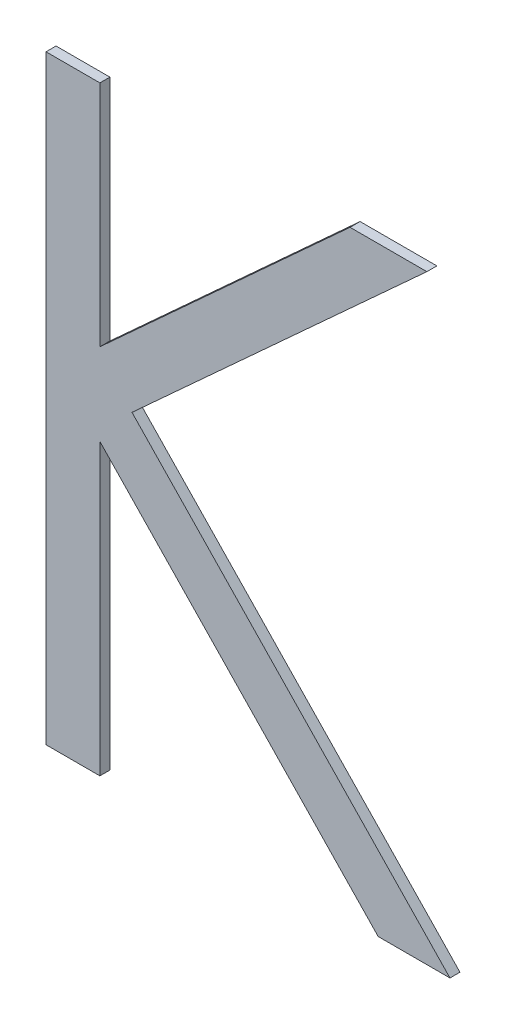
ISO-10303-21;
HEADER;
FILE_DESCRIPTION(('STEP AP214'),'2;1');
FILE_NAME('part.step','',(''),(''),'','','');
FILE_SCHEMA(('AUTOMOTIVE_DESIGN { 1 0 10303 214 1 1 1 1 }'));
ENDSEC;
DATA;
#1=APPLICATION_CONTEXT('core data for automotive mechanical design processes');
#2=APPLICATION_PROTOCOL_DEFINITION('international standard','automotive_design',2000,#1);
#3=PRODUCT_CONTEXT('',#1,'mechanical');
#4=PRODUCT('Part','Part','',(#3));
#5=PRODUCT_RELATED_PRODUCT_CATEGORY('part','',(#4));
#6=PRODUCT_DEFINITION_FORMATION('','',#4);
#7=PRODUCT_DEFINITION_CONTEXT('part definition',#1,'design');
#8=PRODUCT_DEFINITION('design','',#6,#7);
#9=PRODUCT_DEFINITION_SHAPE('','',#8);
#10=(LENGTH_UNIT() NAMED_UNIT(*) SI_UNIT(.MILLI.,.METRE.));
#11=(NAMED_UNIT(*) PLANE_ANGLE_UNIT() SI_UNIT($,.RADIAN.));
#12=(NAMED_UNIT(*) SI_UNIT($,.STERADIAN.) SOLID_ANGLE_UNIT());
#13=UNCERTAINTY_MEASURE_WITH_UNIT(LENGTH_MEASURE(1.E-05),#10,'distance_accuracy_value','');
#14=(GEOMETRIC_REPRESENTATION_CONTEXT(3) GLOBAL_UNCERTAINTY_ASSIGNED_CONTEXT((#13)) GLOBAL_UNIT_ASSIGNED_CONTEXT((#10,
#11,#12)) REPRESENTATION_CONTEXT('',''));
#15=CARTESIAN_POINT('',(0.,0.,0.));
#16=DIRECTION('',(0.,0.,1.));
#17=DIRECTION('',(1.,0.,0.));
#18=AXIS2_PLACEMENT_3D('',#15,#16,#17);
#19=CARTESIAN_POINT('',(1.32461538461538,0.190058603834586,0.551));
#20=DIRECTION('',(-1.,0.,0.));
#21=DIRECTION('',(0.,0.,1.));
#22=AXIS2_PLACEMENT_3D('',#19,#20,#21);
#23=PLANE('',#22);
#24=DIRECTION('',(0.,1.,0.));
#25=VECTOR('',#24,1.);
#26=CARTESIAN_POINT('',(1.32461538461538,0.190058603834586,0.55));
#27=LINE('',#26,#25);
#28=CARTESIAN_POINT('',(1.32461538461538,0.190058603834586,0.55));
#29=VERTEX_POINT('',#28);
#30=CARTESIAN_POINT('',(1.32461538461538,0.250058603834586,0.55));
#31=VERTEX_POINT('',#30);
#32=EDGE_CURVE('E11',#29,#31,#27,.T.);
#33=ORIENTED_EDGE('',*,*,#32,.F.);
#34=DIRECTION('',(0.,0.,-1.));
#35=VECTOR('',#34,1.);
#36=CARTESIAN_POINT('',(1.32461538461538,0.190058603834586,0.551));
#37=LINE('',#36,#35);
#38=CARTESIAN_POINT('',(1.32461538461538,0.190058603834586,0.551));
#39=VERTEX_POINT('',#38);
#40=EDGE_CURVE('E194',#39,#29,#37,.T.);
#41=ORIENTED_EDGE('',*,*,#40,.F.);
#42=DIRECTION('',(0.,1.,0.));
#43=VECTOR('',#42,1.);
#44=CARTESIAN_POINT('',(1.32461538461538,0.190058603834586,0.551));
#45=LINE('',#44,#43);
#46=CARTESIAN_POINT('',(1.32461538461538,0.250058603834586,0.551));
#47=VERTEX_POINT('',#46);
#48=EDGE_CURVE('E187',#39,#47,#45,.T.);
#49=ORIENTED_EDGE('',*,*,#48,.T.);
#50=DIRECTION('',(0.,0.,-1.));
#51=VECTOR('',#50,1.);
#52=CARTESIAN_POINT('',(1.32461538461538,0.250058603834586,0.551));
#53=LINE('',#52,#51);
#54=EDGE_CURVE('E115',#47,#31,#53,.T.);
#55=ORIENTED_EDGE('',*,*,#54,.T.);
#56=EDGE_LOOP('',(#33,#41,#49,#55));
#57=FACE_BOUND('',#56,.T.);
#58=ADVANCED_FACE('F17',(#57),#23,.T.);
#59=CARTESIAN_POINT('',(1.33,0.190058603834586,0.551));
#60=DIRECTION('',(0.,-1.,0.));
#61=DIRECTION('',(0.,0.,-1.));
#62=AXIS2_PLACEMENT_3D('',#59,#60,#61);
#63=PLANE('',#62);
#64=DIRECTION('',(-1.,0.,0.));
#65=VECTOR('',#64,1.);
#66=CARTESIAN_POINT('',(1.33,0.190058603834586,0.55));
#67=LINE('',#66,#65);
#68=CARTESIAN_POINT('',(1.33,0.190058603834586,0.55));
#69=VERTEX_POINT('',#68);
#70=EDGE_CURVE('E24',#69,#29,#67,.T.);
#71=ORIENTED_EDGE('',*,*,#70,.F.);
#72=DIRECTION('',(-2.22044604925006E-13,0.,-1.));
#73=VECTOR('',#72,1.);
#74=CARTESIAN_POINT('',(1.33,0.190058603834586,0.551));
#75=LINE('',#74,#73);
#76=CARTESIAN_POINT('',(1.33,0.190058603834586,0.551));
#77=VERTEX_POINT('',#76);
#78=EDGE_CURVE('E189',#77,#69,#75,.T.);
#79=ORIENTED_EDGE('',*,*,#78,.F.);
#80=DIRECTION('',(-1.,0.,0.));
#81=VECTOR('',#80,1.);
#82=CARTESIAN_POINT('',(1.33,0.190058603834586,0.551));
#83=LINE('',#82,#81);
#84=EDGE_CURVE('E178',#77,#39,#83,.T.);
#85=ORIENTED_EDGE('',*,*,#84,.T.);
#86=ORIENTED_EDGE('',*,*,#40,.T.);
#87=EDGE_LOOP('',(#71,#79,#85,#86));
#88=FACE_BOUND('',#87,.T.);
#89=ADVANCED_FACE('F205',(#88),#63,.T.);
#90=CARTESIAN_POINT('',(1.33,0.219012930757663,0.551));
#91=DIRECTION('',(1.,0.,0.));
#92=DIRECTION('',(0.,0.,-1.));
#93=AXIS2_PLACEMENT_3D('',#90,#91,#92);
#94=PLANE('',#93);
#95=DIRECTION('',(0.,-1.,0.));
#96=VECTOR('',#95,1.);
#97=CARTESIAN_POINT('',(1.33,0.219012930757663,0.55));
#98=LINE('',#97,#96);
#99=CARTESIAN_POINT('',(1.33,0.219012930757663,0.55));
#100=VERTEX_POINT('',#99);
#101=EDGE_CURVE('E191',#100,#69,#98,.T.);
#102=ORIENTED_EDGE('',*,*,#101,.F.);
#103=DIRECTION('',(-2.22044604925006E-13,0.,-1.));
#104=VECTOR('',#103,1.);
#105=CARTESIAN_POINT('',(1.33,0.219012930757663,0.551));
#106=LINE('',#105,#104);
#107=CARTESIAN_POINT('',(1.33,0.219012930757663,0.551));
#108=VERTEX_POINT('',#107);
#109=EDGE_CURVE('E181',#108,#100,#106,.T.);
#110=ORIENTED_EDGE('',*,*,#109,.F.);
#111=DIRECTION('',(0.,-1.,0.));
#112=VECTOR('',#111,1.);
#113=CARTESIAN_POINT('',(1.33,0.219012930757663,0.551));
#114=LINE('',#113,#112);
#115=EDGE_CURVE('E168',#108,#77,#114,.T.);
#116=ORIENTED_EDGE('',*,*,#115,.T.);
#117=ORIENTED_EDGE('',*,*,#78,.T.);
#118=EDGE_LOOP('',(#102,#110,#116,#117));
#119=FACE_BOUND('',#118,.T.);
#120=ADVANCED_FACE('F198',(#119),#94,.T.);
#121=CARTESIAN_POINT('',(1.35782451923077,0.190058603834586,0.551));
#122=DIRECTION('',(-0.721034337340713,-0.692899332064651,0.));
#123=DIRECTION('',(0.692899332064651,-0.721034337340713,0.));
#124=AXIS2_PLACEMENT_3D('',#121,#122,#123);
#125=PLANE('',#124);
#126=DIRECTION('',(-0.692899332064651,0.721034337340713,0.));
#127=VECTOR('',#126,1.);
#128=CARTESIAN_POINT('',(1.35782451923077,0.190058603834586,0.55));
#129=LINE('',#128,#127);
#130=CARTESIAN_POINT('',(1.35782451923077,0.190058603834586,0.55));
#131=VERTEX_POINT('',#130);
#132=EDGE_CURVE('E184',#131,#100,#129,.T.);
#133=ORIENTED_EDGE('',*,*,#132,.F.);
#134=DIRECTION('',(0.,0.,-1.));
#135=VECTOR('',#134,1.);
#136=CARTESIAN_POINT('',(1.35782451923077,0.190058603834586,0.551));
#137=LINE('',#136,#135);
#138=CARTESIAN_POINT('',(1.35782451923077,0.190058603834586,0.551));
#139=VERTEX_POINT('',#138);
#140=EDGE_CURVE('E171',#139,#131,#137,.T.);
#141=ORIENTED_EDGE('',*,*,#140,.F.);
#142=DIRECTION('',(-0.692899332064651,0.721034337340713,0.));
#143=VECTOR('',#142,1.);
#144=CARTESIAN_POINT('',(1.35782451923077,0.190058603834586,0.551));
#145=LINE('',#144,#143);
#146=EDGE_CURVE('E159',#139,#108,#145,.T.);
#147=ORIENTED_EDGE('',*,*,#146,.T.);
#148=ORIENTED_EDGE('',*,*,#109,.T.);
#149=EDGE_LOOP('',(#133,#141,#147,#148));
#150=FACE_BOUND('',#149,.T.);
#151=ADVANCED_FACE('F200',(#150),#125,.T.);
#152=CARTESIAN_POINT('',(1.365,0.190058603834586,0.551));
#153=DIRECTION('',(0.,-1.,0.));
#154=DIRECTION('',(0.,0.,-1.));
#155=AXIS2_PLACEMENT_3D('',#152,#153,#154);
#156=PLANE('',#155);
#157=DIRECTION('',(-1.,0.,0.));
#158=VECTOR('',#157,1.);
#159=CARTESIAN_POINT('',(1.365,0.190058603834586,0.55));
#160=LINE('',#159,#158);
#161=CARTESIAN_POINT('',(1.365,0.190058603834586,0.55));
#162=VERTEX_POINT('',#161);
#163=EDGE_CURVE('E174',#162,#131,#160,.T.);
#164=ORIENTED_EDGE('',*,*,#163,.F.);
#165=DIRECTION('',(-2.22044604925006E-13,0.,-1.));
#166=VECTOR('',#165,1.);
#167=CARTESIAN_POINT('',(1.365,0.190058603834586,0.551));
#168=LINE('',#167,#166);
#169=CARTESIAN_POINT('',(1.365,0.190058603834586,0.551));
#170=VERTEX_POINT('',#169);
#171=EDGE_CURVE('E162',#170,#162,#168,.T.);
#172=ORIENTED_EDGE('',*,*,#171,.F.);
#173=DIRECTION('',(-1.,0.,0.));
#174=VECTOR('',#173,1.);
#175=CARTESIAN_POINT('',(1.365,0.190058603834586,0.551));
#176=LINE('',#175,#174);
#177=EDGE_CURVE('E150',#170,#139,#176,.T.);
#178=ORIENTED_EDGE('',*,*,#177,.T.);
#179=ORIENTED_EDGE('',*,*,#140,.T.);
#180=EDGE_LOOP('',(#164,#172,#178,#179));
#181=FACE_BOUND('',#180,.T.);
#182=ADVANCED_FACE('F217',(#181),#156,.T.);
#183=CARTESIAN_POINT('',(1.33320913461538,0.223135526911509,0.551));
#184=DIRECTION('',(0.720984077089344,0.692951629324606,0.));
#185=DIRECTION('',(-0.692951629324606,0.720984077089344,0.));
#186=AXIS2_PLACEMENT_3D('',#183,#184,#185);
#187=PLANE('',#186);
#188=DIRECTION('',(0.692951629324607,-0.720984077089344,0.));
#189=VECTOR('',#188,1.);
#190=CARTESIAN_POINT('',(1.33320913461538,0.223135526911509,0.55));
#191=LINE('',#190,#189);
#192=CARTESIAN_POINT('',(1.33320913461538,0.223135526911509,0.55));
#193=VERTEX_POINT('',#192);
#194=EDGE_CURVE('E165',#193,#162,#191,.T.);
#195=ORIENTED_EDGE('',*,*,#194,.F.);
#196=DIRECTION('',(0.,0.,-1.));
#197=VECTOR('',#196,1.);
#198=CARTESIAN_POINT('',(1.33320913461538,0.223135526911509,0.551));
#199=LINE('',#198,#197);
#200=CARTESIAN_POINT('',(1.33320913461538,0.223135526911509,0.551));
#201=VERTEX_POINT('',#200);
#202=EDGE_CURVE('E153',#201,#193,#199,.T.);
#203=ORIENTED_EDGE('',*,*,#202,.F.);
#204=DIRECTION('',(0.692951629324607,-0.720984077089344,0.));
#205=VECTOR('',#204,1.);
#206=CARTESIAN_POINT('',(1.33320913461538,0.223135526911509,0.551));
#207=LINE('',#206,#205);
#208=EDGE_CURVE('E141',#201,#170,#207,.T.);
#209=ORIENTED_EDGE('',*,*,#208,.T.);
#210=ORIENTED_EDGE('',*,*,#171,.T.);
#211=EDGE_LOOP('',(#195,#203,#209,#210));
#212=FACE_BOUND('',#211,.T.);
#213=ADVANCED_FACE('F215',(#212),#187,.T.);
#214=CARTESIAN_POINT('',(1.36269230769231,0.250058603834586,0.551));
#215=DIRECTION('',(0.674319328149854,-0.738439871406961,0.));
#216=DIRECTION('',(0.738439871406961,0.674319328149854,0.));
#217=AXIS2_PLACEMENT_3D('',#214,#215,#216);
#218=PLANE('',#217);
#219=DIRECTION('',(-0.738439871406962,-0.674319328149854,0.));
#220=VECTOR('',#219,1.);
#221=CARTESIAN_POINT('',(1.36269230769231,0.250058603834586,0.55));
#222=LINE('',#221,#220);
#223=CARTESIAN_POINT('',(1.36269230769231,0.250058603834586,0.55));
#224=VERTEX_POINT('',#223);
#225=EDGE_CURVE('E156',#224,#193,#222,.T.);
#226=ORIENTED_EDGE('',*,*,#225,.F.);
#227=DIRECTION('',(0.,0.,-1.));
#228=VECTOR('',#227,1.);
#229=CARTESIAN_POINT('',(1.36269230769231,0.250058603834586,0.551));
#230=LINE('',#229,#228);
#231=CARTESIAN_POINT('',(1.36269230769231,0.250058603834586,0.551));
#232=VERTEX_POINT('',#231);
#233=EDGE_CURVE('E144',#232,#224,#230,.T.);
#234=ORIENTED_EDGE('',*,*,#233,.F.);
#235=DIRECTION('',(-0.738439871406962,-0.674319328149854,0.));
#236=VECTOR('',#235,1.);
#237=CARTESIAN_POINT('',(1.36269230769231,0.250058603834586,0.551));
#238=LINE('',#237,#236);
#239=EDGE_CURVE('E132',#232,#201,#238,.T.);
#240=ORIENTED_EDGE('',*,*,#239,.T.);
#241=ORIENTED_EDGE('',*,*,#202,.T.);
#242=EDGE_LOOP('',(#226,#234,#240,#241));
#243=FACE_BOUND('',#242,.T.);
#244=ADVANCED_FACE('F212',(#243),#218,.T.);
#245=CARTESIAN_POINT('',(1.35501201923077,0.250058603834586,0.551));
#246=DIRECTION('',(0.,1.,0.));
#247=DIRECTION('',(0.,0.,1.));
#248=AXIS2_PLACEMENT_3D('',#245,#246,#247);
#249=PLANE('',#248);
#250=DIRECTION('',(1.,0.,0.));
#251=VECTOR('',#250,1.);
#252=CARTESIAN_POINT('',(1.35501201923077,0.250058603834586,0.55));
#253=LINE('',#252,#251);
#254=CARTESIAN_POINT('',(1.35501201923077,0.250058603834586,0.55));
#255=VERTEX_POINT('',#254);
#256=EDGE_CURVE('E147',#255,#224,#253,.T.);
#257=ORIENTED_EDGE('',*,*,#256,.F.);
#258=DIRECTION('',(0.,0.,-1.));
#259=VECTOR('',#258,1.);
#260=CARTESIAN_POINT('',(1.35501201923077,0.250058603834586,0.551));
#261=LINE('',#260,#259);
#262=CARTESIAN_POINT('',(1.35501201923077,0.250058603834586,0.551));
#263=VERTEX_POINT('',#262);
#264=EDGE_CURVE('E135',#263,#255,#261,.T.);
#265=ORIENTED_EDGE('',*,*,#264,.F.);
#266=DIRECTION('',(1.,0.,0.));
#267=VECTOR('',#266,1.);
#268=CARTESIAN_POINT('',(1.35501201923077,0.250058603834586,0.551));
#269=LINE('',#268,#267);
#270=EDGE_CURVE('E126',#263,#232,#269,.T.);
#271=ORIENTED_EDGE('',*,*,#270,.T.);
#272=ORIENTED_EDGE('',*,*,#233,.T.);
#273=EDGE_LOOP('',(#257,#265,#271,#272));
#274=FACE_BOUND('',#273,.T.);
#275=ADVANCED_FACE('F209',(#274),#249,.T.);
#276=CARTESIAN_POINT('',(1.33,0.227210046142279,0.551));
#277=DIRECTION('',(-0.674454418490862,0.738316488626763,0.));
#278=DIRECTION('',(-0.738316488626763,-0.674454418490862,0.));
#279=AXIS2_PLACEMENT_3D('',#276,#277,#278);
#280=PLANE('',#279);
#281=DIRECTION('',(0.738316488626762,0.674454418490863,0.));
#282=VECTOR('',#281,1.);
#283=CARTESIAN_POINT('',(1.33,0.227210046142279,0.55));
#284=LINE('',#283,#282);
#285=CARTESIAN_POINT('',(1.33,0.227210046142279,0.55));
#286=VERTEX_POINT('',#285);
#287=EDGE_CURVE('E138',#286,#255,#284,.T.);
#288=ORIENTED_EDGE('',*,*,#287,.F.);
#289=DIRECTION('',(-2.22044604925006E-13,0.,-1.));
#290=VECTOR('',#289,1.);
#291=CARTESIAN_POINT('',(1.33,0.227210046142279,0.551));
#292=LINE('',#291,#290);
#293=CARTESIAN_POINT('',(1.33,0.227210046142279,0.551));
#294=VERTEX_POINT('',#293);
#295=EDGE_CURVE('E129',#294,#286,#292,.T.);
#296=ORIENTED_EDGE('',*,*,#295,.F.);
#297=DIRECTION('',(0.738316488626762,0.674454418490863,0.));
#298=VECTOR('',#297,1.);
#299=CARTESIAN_POINT('',(1.33,0.227210046142279,0.551));
#300=LINE('',#299,#298);
#301=EDGE_CURVE('E109',#294,#263,#300,.T.);
#302=ORIENTED_EDGE('',*,*,#301,.T.);
#303=ORIENTED_EDGE('',*,*,#264,.T.);
#304=EDGE_LOOP('',(#288,#296,#302,#303));
#305=FACE_BOUND('',#304,.T.);
#306=ADVANCED_FACE('F207',(#305),#280,.T.);
#307=CARTESIAN_POINT('',(1.33,0.250058603834586,0.551));
#308=DIRECTION('',(1.,0.,0.));
#309=DIRECTION('',(0.,0.,-1.));
#310=AXIS2_PLACEMENT_3D('',#307,#308,#309);
#311=PLANE('',#310);
#312=DIRECTION('',(0.,-1.,0.));
#313=VECTOR('',#312,1.);
#314=CARTESIAN_POINT('',(1.33,0.250058603834586,0.55));
#315=LINE('',#314,#313);
#316=CARTESIAN_POINT('',(1.33,0.250058603834586,0.55));
#317=VERTEX_POINT('',#316);
#318=EDGE_CURVE('E104',#317,#286,#315,.T.);
#319=ORIENTED_EDGE('',*,*,#318,.F.);
#320=DIRECTION('',(-2.22044604925006E-13,0.,-1.));
#321=VECTOR('',#320,1.);
#322=CARTESIAN_POINT('',(1.33,0.250058603834586,0.551));
#323=LINE('',#322,#321);
#324=CARTESIAN_POINT('',(1.33,0.250058603834586,0.551));
#325=VERTEX_POINT('',#324);
#326=EDGE_CURVE('E96',#325,#317,#323,.T.);
#327=ORIENTED_EDGE('',*,*,#326,.F.);
#328=DIRECTION('',(0.,-1.,0.));
#329=VECTOR('',#328,1.);
#330=CARTESIAN_POINT('',(1.33,0.250058603834586,0.551));
#331=LINE('',#330,#329);
#332=EDGE_CURVE('E101',#325,#294,#331,.T.);
#333=ORIENTED_EDGE('',*,*,#332,.T.);
#334=ORIENTED_EDGE('',*,*,#295,.T.);
#335=EDGE_LOOP('',(#319,#327,#333,#334));
#336=FACE_BOUND('',#335,.T.);
#337=ADVANCED_FACE('F98',(#336),#311,.T.);
#338=CARTESIAN_POINT('',(1.32461538461538,0.250058603834586,0.551));
#339=DIRECTION('',(0.,1.,0.));
#340=DIRECTION('',(0.,0.,1.));
#341=AXIS2_PLACEMENT_3D('',#338,#339,#340);
#342=PLANE('',#341);
#343=DIRECTION('',(1.,0.,0.));
#344=VECTOR('',#343,1.);
#345=CARTESIAN_POINT('',(1.32461538461538,0.250058603834586,0.55));
#346=LINE('',#345,#344);
#347=EDGE_CURVE('E108',#31,#317,#346,.T.);
#348=ORIENTED_EDGE('',*,*,#347,.F.);
#349=ORIENTED_EDGE('',*,*,#54,.F.);
#350=DIRECTION('',(1.,0.,0.));
#351=VECTOR('',#350,1.);
#352=CARTESIAN_POINT('',(1.32461538461538,0.250058603834586,0.551));
#353=LINE('',#352,#351);
#354=EDGE_CURVE('E113',#47,#325,#353,.T.);
#355=ORIENTED_EDGE('',*,*,#354,.T.);
#356=ORIENTED_EDGE('',*,*,#326,.T.);
#357=EDGE_LOOP('',(#348,#349,#355,#356));
#358=FACE_BOUND('',#357,.T.);
#359=ADVANCED_FACE('F114',(#358),#342,.T.);
#360=CARTESIAN_POINT('',(0.,0.,0.551));
#361=DIRECTION('',(0.,0.,-1.));
#362=DIRECTION('',(-1.,0.,0.));
#363=AXIS2_PLACEMENT_3D('',#360,#361,#362);
#364=PLANE('',#363);
#365=ORIENTED_EDGE('',*,*,#48,.F.);
#366=ORIENTED_EDGE('',*,*,#84,.F.);
#367=ORIENTED_EDGE('',*,*,#115,.F.);
#368=ORIENTED_EDGE('',*,*,#146,.F.);
#369=ORIENTED_EDGE('',*,*,#177,.F.);
#370=ORIENTED_EDGE('',*,*,#208,.F.);
#371=ORIENTED_EDGE('',*,*,#239,.F.);
#372=ORIENTED_EDGE('',*,*,#270,.F.);
#373=ORIENTED_EDGE('',*,*,#301,.F.);
#374=ORIENTED_EDGE('',*,*,#332,.F.);
#375=ORIENTED_EDGE('',*,*,#354,.F.);
#376=EDGE_LOOP('',(#365,#366,#367,#368,#369,#370,#371,#372,#373,#374,#375));
#377=FACE_BOUND('',#376,.T.);
#378=ADVANCED_FACE('F119',(#377),#364,.F.);
#379=CARTESIAN_POINT('',(0.,0.,0.55));
#380=DIRECTION('',(0.,0.,-1.));
#381=DIRECTION('',(-1.,0.,0.));
#382=AXIS2_PLACEMENT_3D('',#379,#380,#381);
#383=PLANE('',#382);
#384=ORIENTED_EDGE('',*,*,#32,.T.);
#385=ORIENTED_EDGE('',*,*,#347,.T.);
#386=ORIENTED_EDGE('',*,*,#318,.T.);
#387=ORIENTED_EDGE('',*,*,#287,.T.);
#388=ORIENTED_EDGE('',*,*,#256,.T.);
#389=ORIENTED_EDGE('',*,*,#225,.T.);
#390=ORIENTED_EDGE('',*,*,#194,.T.);
#391=ORIENTED_EDGE('',*,*,#163,.T.);
#392=ORIENTED_EDGE('',*,*,#132,.T.);
#393=ORIENTED_EDGE('',*,*,#101,.T.);
#394=ORIENTED_EDGE('',*,*,#70,.T.);
#395=EDGE_LOOP('',(#384,#385,#386,#387,#388,#389,#390,#391,#392,#393,#394));
#396=FACE_BOUND('',#395,.T.);
#397=ADVANCED_FACE('F196',(#396),#383,.T.);
#398=CLOSED_SHELL('',(#58,#89,#120,#151,#182,#213,#244,#275,#306,#337,#359,#378,#397));
#399=MANIFOLD_SOLID_BREP('B1',#398);
#400=ADVANCED_BREP_SHAPE_REPRESENTATION('',(#18,#399),#14);
#401=SHAPE_DEFINITION_REPRESENTATION(#9,#400);
ENDSEC;
END-ISO-10303-21;
